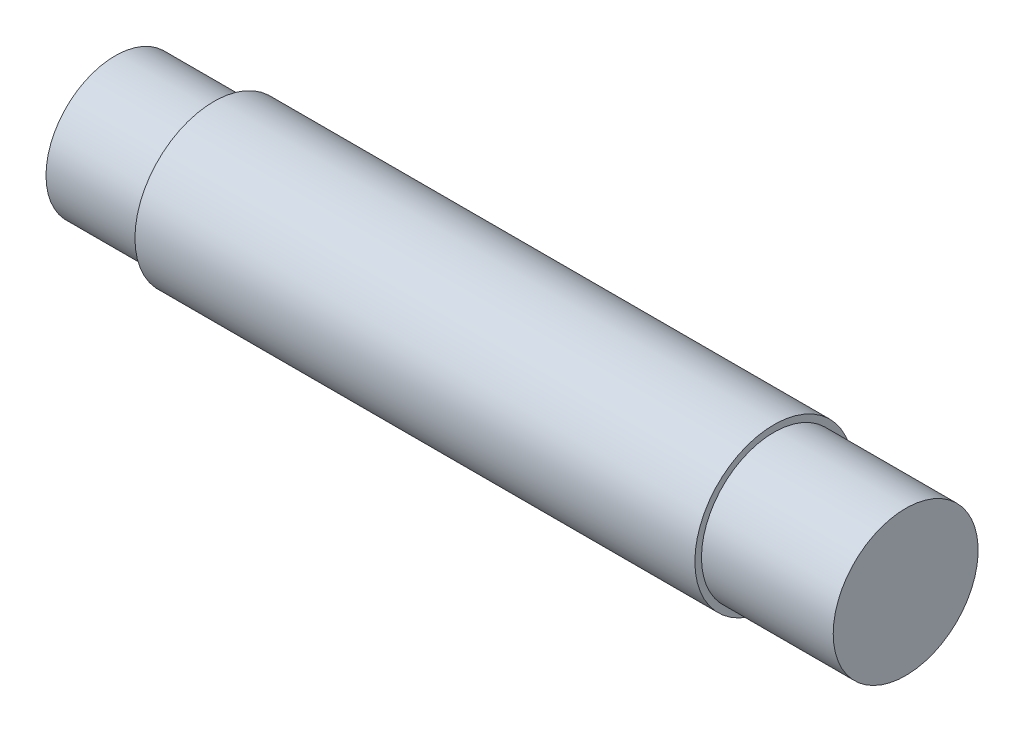
ISO-10303-21;
HEADER;
FILE_DESCRIPTION(('STEP AP214'),'2;1');
FILE_NAME('part.step','',(''),(''),'','','');
FILE_SCHEMA(('AUTOMOTIVE_DESIGN { 1 0 10303 214 1 1 1 1 }'));
ENDSEC;
DATA;
#1=APPLICATION_CONTEXT('core data for automotive mechanical design processes');
#2=APPLICATION_PROTOCOL_DEFINITION('international standard','automotive_design',2000,#1);
#3=PRODUCT_CONTEXT('',#1,'mechanical');
#4=PRODUCT('Part','Part','',(#3));
#5=PRODUCT_RELATED_PRODUCT_CATEGORY('part','',(#4));
#6=PRODUCT_DEFINITION_FORMATION('','',#4);
#7=PRODUCT_DEFINITION_CONTEXT('part definition',#1,'design');
#8=PRODUCT_DEFINITION('design','',#6,#7);
#9=PRODUCT_DEFINITION_SHAPE('','',#8);
#10=(LENGTH_UNIT() NAMED_UNIT(*) SI_UNIT(.MILLI.,.METRE.));
#11=(NAMED_UNIT(*) PLANE_ANGLE_UNIT() SI_UNIT($,.RADIAN.));
#12=(NAMED_UNIT(*) SI_UNIT($,.STERADIAN.) SOLID_ANGLE_UNIT());
#13=UNCERTAINTY_MEASURE_WITH_UNIT(LENGTH_MEASURE(1.E-05),#10,'distance_accuracy_value','');
#14=(GEOMETRIC_REPRESENTATION_CONTEXT(3) GLOBAL_UNCERTAINTY_ASSIGNED_CONTEXT((#13)) GLOBAL_UNIT_ASSIGNED_CONTEXT((#10,
#11,#12)) REPRESENTATION_CONTEXT('',''));
#15=CARTESIAN_POINT('',(0.,0.,0.));
#16=DIRECTION('',(0.,0.,1.));
#17=DIRECTION('',(1.,0.,0.));
#18=AXIS2_PLACEMENT_3D('',#15,#16,#17);
#19=CARTESIAN_POINT('',(0.,5.25,0.));
#20=DIRECTION('',(1.,0.,0.));
#21=DIRECTION('',(0.,0.,-1.));
#22=AXIS2_PLACEMENT_3D('',#19,#20,#21);
#23=PLANE('',#22);
#24=CARTESIAN_POINT('',(0.,0.,0.));
#25=DIRECTION('',(-1.,0.,0.));
#26=DIRECTION('',(0.,0.,1.));
#27=AXIS2_PLACEMENT_3D('',#24,#25,#26);
#28=CIRCLE('',#27,5.25);
#29=CARTESIAN_POINT('',(0.,0.,5.25));
#30=VERTEX_POINT('',#29);
#31=EDGE_CURVE('E55',#30,#30,#28,.T.);
#32=ORIENTED_EDGE('',*,*,#31,.T.);
#33=EDGE_LOOP('',(#32));
#34=FACE_BOUND('',#33,.T.);
#35=ADVANCED_FACE('F33',(#34),#23,.F.);
#36=CARTESIAN_POINT('',(60.,0.,0.));
#37=DIRECTION('',(-1.,0.,0.));
#38=DIRECTION('',(0.,0.,1.));
#39=AXIS2_PLACEMENT_3D('',#36,#37,#38);
#40=PLANE('',#39);
#41=CARTESIAN_POINT('',(60.,0.,0.));
#42=DIRECTION('',(-1.,0.,0.));
#43=DIRECTION('',(0.,0.,1.));
#44=AXIS2_PLACEMENT_3D('',#41,#42,#43);
#45=CIRCLE('',#44,5.5);
#46=CARTESIAN_POINT('',(60.,0.,5.5));
#47=VERTEX_POINT('',#46);
#48=EDGE_CURVE('E10',#47,#47,#45,.T.);
#49=ORIENTED_EDGE('',*,*,#48,.F.);
#50=EDGE_LOOP('',(#49));
#51=FACE_BOUND('',#50,.T.);
#52=ADVANCED_FACE('F85',(#51),#40,.F.);
#53=CARTESIAN_POINT('',(-6.16684731119903,0.,0.));
#54=DIRECTION('',(-1.,0.,0.));
#55=DIRECTION('',(0.,0.,1.));
#56=AXIS2_PLACEMENT_3D('',#53,#54,#55);
#57=CYLINDRICAL_SURFACE('',#56,5.5);
#58=CARTESIAN_POINT('',(50.,0.,0.));
#59=DIRECTION('',(-1.,0.,0.));
#60=DIRECTION('',(0.,0.,1.));
#61=AXIS2_PLACEMENT_3D('',#58,#59,#60);
#62=CIRCLE('',#61,5.5);
#63=CARTESIAN_POINT('',(50.,0.,5.5));
#64=VERTEX_POINT('',#63);
#65=EDGE_CURVE('E39',#64,#64,#62,.T.);
#66=ORIENTED_EDGE('',*,*,#65,.F.);
#67=EDGE_LOOP('',(#66));
#68=FACE_BOUND('',#67,.T.);
#69=ORIENTED_EDGE('',*,*,#48,.T.);
#70=EDGE_LOOP('',(#69));
#71=FACE_BOUND('',#70,.T.);
#72=ADVANCED_FACE('F80',(#68,#71),#57,.T.);
#73=CARTESIAN_POINT('',(50.,5.5,0.));
#74=DIRECTION('',(-1.,0.,0.));
#75=DIRECTION('',(0.,0.,1.));
#76=AXIS2_PLACEMENT_3D('',#73,#74,#75);
#77=PLANE('',#76);
#78=CARTESIAN_POINT('',(50.,0.,0.));
#79=DIRECTION('',(-1.,0.,0.));
#80=DIRECTION('',(0.,0.,1.));
#81=AXIS2_PLACEMENT_3D('',#78,#79,#80);
#82=CIRCLE('',#81,6.);
#83=CARTESIAN_POINT('',(50.,0.,6.));
#84=VERTEX_POINT('',#83);
#85=EDGE_CURVE('E43',#84,#84,#82,.T.);
#86=ORIENTED_EDGE('',*,*,#85,.F.);
#87=EDGE_LOOP('',(#86));
#88=FACE_BOUND('',#87,.T.);
#89=ORIENTED_EDGE('',*,*,#65,.T.);
#90=EDGE_LOOP('',(#89));
#91=FACE_BOUND('',#90,.T.);
#92=ADVANCED_FACE('F75',(#88,#91),#77,.F.);
#93=CARTESIAN_POINT('',(-6.16684731119903,0.,0.));
#94=DIRECTION('',(-1.,0.,0.));
#95=DIRECTION('',(0.,0.,1.));
#96=AXIS2_PLACEMENT_3D('',#93,#94,#95);
#97=CYLINDRICAL_SURFACE('',#96,6.);
#98=CARTESIAN_POINT('',(7.5,0.,0.));
#99=DIRECTION('',(-1.,0.,0.));
#100=DIRECTION('',(0.,0.,1.));
#101=AXIS2_PLACEMENT_3D('',#98,#99,#100);
#102=CIRCLE('',#101,5.99999999999999);
#103=CARTESIAN_POINT('',(7.5,0.,5.99999999999999));
#104=VERTEX_POINT('',#103);
#105=EDGE_CURVE('E47',#104,#104,#102,.T.);
#106=ORIENTED_EDGE('',*,*,#105,.F.);
#107=EDGE_LOOP('',(#106));
#108=FACE_BOUND('',#107,.T.);
#109=ORIENTED_EDGE('',*,*,#85,.T.);
#110=EDGE_LOOP('',(#109));
#111=FACE_BOUND('',#110,.T.);
#112=ADVANCED_FACE('F69',(#108,#111),#97,.T.);
#113=CARTESIAN_POINT('',(7.5,5.99999999999999,0.));
#114=DIRECTION('',(1.,0.,0.));
#115=DIRECTION('',(0.,0.,-1.));
#116=AXIS2_PLACEMENT_3D('',#113,#114,#115);
#117=PLANE('',#116);
#118=CARTESIAN_POINT('',(7.5,0.,0.));
#119=DIRECTION('',(-1.,0.,0.));
#120=DIRECTION('',(0.,0.,1.));
#121=AXIS2_PLACEMENT_3D('',#118,#119,#120);
#122=CIRCLE('',#121,5.25);
#123=CARTESIAN_POINT('',(7.5,0.,5.25));
#124=VERTEX_POINT('',#123);
#125=EDGE_CURVE('E52',#124,#124,#122,.T.);
#126=ORIENTED_EDGE('',*,*,#125,.F.);
#127=EDGE_LOOP('',(#126));
#128=FACE_BOUND('',#127,.T.);
#129=ORIENTED_EDGE('',*,*,#105,.T.);
#130=EDGE_LOOP('',(#129));
#131=FACE_BOUND('',#130,.T.);
#132=ADVANCED_FACE('F63',(#128,#131),#117,.F.);
#133=CARTESIAN_POINT('',(-6.16684731119903,0.,0.));
#134=DIRECTION('',(-1.,0.,0.));
#135=DIRECTION('',(0.,0.,1.));
#136=AXIS2_PLACEMENT_3D('',#133,#134,#135);
#137=CYLINDRICAL_SURFACE('',#136,5.25);
#138=ORIENTED_EDGE('',*,*,#31,.F.);
#139=EDGE_LOOP('',(#138));
#140=FACE_BOUND('',#139,.T.);
#141=ORIENTED_EDGE('',*,*,#125,.T.);
#142=EDGE_LOOP('',(#141));
#143=FACE_BOUND('',#142,.T.);
#144=ADVANCED_FACE('F60',(#140,#143),#137,.T.);
#145=CLOSED_SHELL('',(#35,#52,#72,#92,#112,#132,#144));
#146=MANIFOLD_SOLID_BREP('B2',#145);
#147=ADVANCED_BREP_SHAPE_REPRESENTATION('',(#18,#146),#14);
#148=SHAPE_DEFINITION_REPRESENTATION(#9,#147);
ENDSEC;
END-ISO-10303-21;
